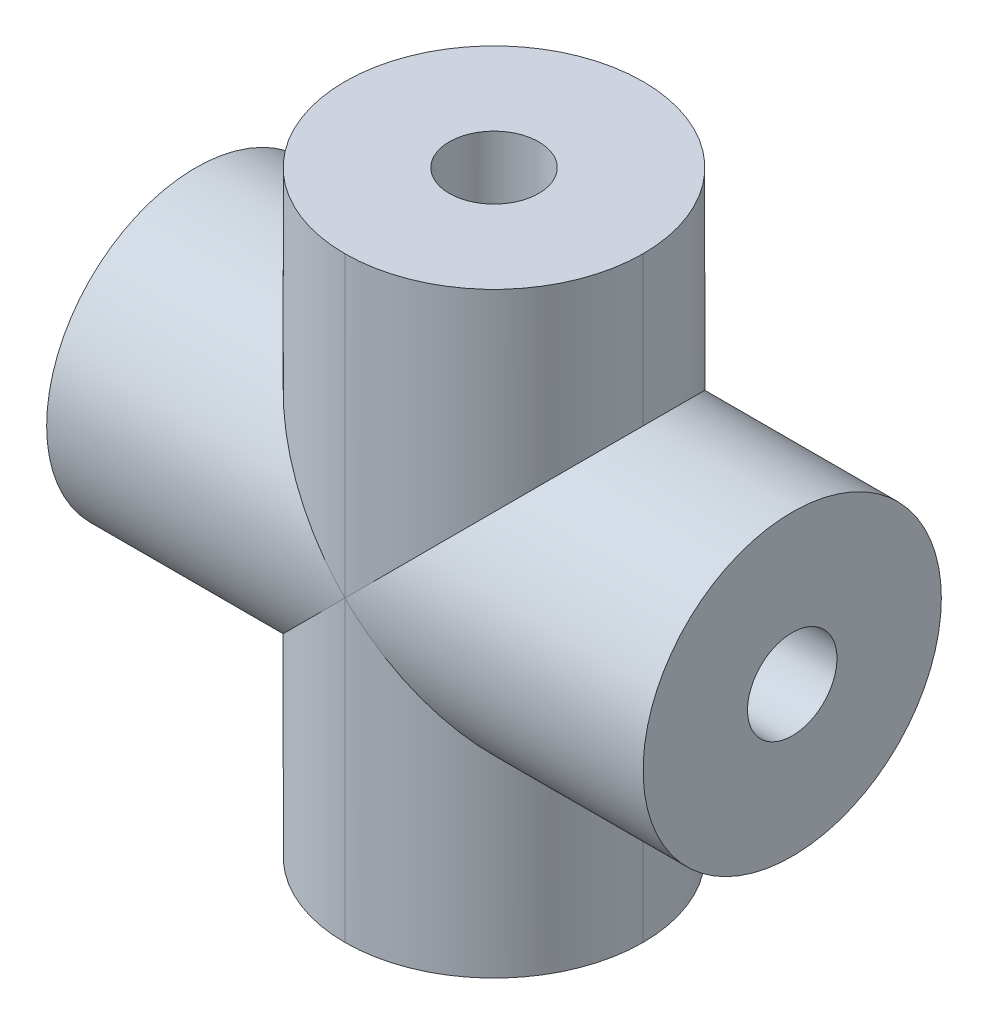
ISO-10303-21;
HEADER;
FILE_DESCRIPTION(('STEP AP214'),'2;1');
FILE_NAME('part.step','',(''),(''),'','','');
FILE_SCHEMA(('AUTOMOTIVE_DESIGN { 1 0 10303 214 1 1 1 1 }'));
ENDSEC;
DATA;
#1=APPLICATION_CONTEXT('core data for automotive mechanical design processes');
#2=APPLICATION_PROTOCOL_DEFINITION('international standard','automotive_design',2000,#1);
#3=PRODUCT_CONTEXT('',#1,'mechanical');
#4=PRODUCT('Part','Part','',(#3));
#5=PRODUCT_RELATED_PRODUCT_CATEGORY('part','',(#4));
#6=PRODUCT_DEFINITION_FORMATION('','',#4);
#7=PRODUCT_DEFINITION_CONTEXT('part definition',#1,'design');
#8=PRODUCT_DEFINITION('design','',#6,#7);
#9=PRODUCT_DEFINITION_SHAPE('','',#8);
#10=(LENGTH_UNIT() NAMED_UNIT(*) SI_UNIT(.MILLI.,.METRE.));
#11=(NAMED_UNIT(*) PLANE_ANGLE_UNIT() SI_UNIT($,.RADIAN.));
#12=(NAMED_UNIT(*) SI_UNIT($,.STERADIAN.) SOLID_ANGLE_UNIT());
#13=UNCERTAINTY_MEASURE_WITH_UNIT(LENGTH_MEASURE(1.E-05),#10,'distance_accuracy_value','');
#14=(GEOMETRIC_REPRESENTATION_CONTEXT(3) GLOBAL_UNCERTAINTY_ASSIGNED_CONTEXT((#13)) GLOBAL_UNIT_ASSIGNED_CONTEXT((#10,
#11,#12)) REPRESENTATION_CONTEXT('',''));
#15=CARTESIAN_POINT('',(0.,0.,0.));
#16=DIRECTION('',(0.,0.,1.));
#17=DIRECTION('',(1.,0.,0.));
#18=AXIS2_PLACEMENT_3D('',#15,#16,#17);
#19=CARTESIAN_POINT('',(-5.,20.,-4.99999999999999));
#20=DIRECTION('',(0.,1.,0.));
#21=DIRECTION('',(0.,0.,1.));
#22=AXIS2_PLACEMENT_3D('',#19,#20,#21);
#23=CYLINDRICAL_SURFACE('',#22,1.49999999999999);
#24=CARTESIAN_POINT('',(-5.,20.,-4.99999999999999));
#25=DIRECTION('',(0.,1.,0.));
#26=DIRECTION('',(0.,0.,1.));
#27=AXIS2_PLACEMENT_3D('',#24,#25,#26);
#28=CIRCLE('',#27,1.49999999999999);
#29=CARTESIAN_POINT('',(-5.,20.,-3.50000000000001));
#30=VERTEX_POINT('',#29);
#31=EDGE_CURVE('E175',#30,#30,#28,.T.);
#32=ORIENTED_EDGE('',*,*,#31,.T.);
#33=EDGE_LOOP('',(#32));
#34=FACE_BOUND('',#33,.T.);
#35=CARTESIAN_POINT('',(-5.,10.,-4.99999999999999));
#36=DIRECTION('',(0.707106781186547,0.707106781186547,0.));
#37=DIRECTION('',(-0.707106781186547,0.707106781186547,0.));
#38=AXIS2_PLACEMENT_3D('',#35,#36,#37);
#39=ELLIPSE('',#38,2.12132034355963,1.49999999999999);
#40=CARTESIAN_POINT('',(-5.,10.,-3.5));
#41=VERTEX_POINT('',#40);
#42=CARTESIAN_POINT('',(-5.,10.,-6.49999999999999));
#43=VERTEX_POINT('',#42);
#44=EDGE_CURVE('E46',#41,#43,#39,.F.);
#45=ORIENTED_EDGE('',*,*,#44,.T.);
#46=CARTESIAN_POINT('',(-5.,10.,-4.99999999999999));
#47=DIRECTION('',(-0.707106781186547,0.707106781186547,0.));
#48=DIRECTION('',(0.707106781186547,0.707106781186547,0.));
#49=AXIS2_PLACEMENT_3D('',#46,#47,#48);
#50=ELLIPSE('',#49,2.12132034355963,1.49999999999999);
#51=EDGE_CURVE('E11',#43,#41,#50,.F.);
#52=ORIENTED_EDGE('',*,*,#51,.T.);
#53=EDGE_LOOP('',(#45,#52));
#54=FACE_BOUND('',#53,.T.);
#55=ADVANCED_FACE('F33',(#34,#54),#23,.F.);
#56=CARTESIAN_POINT('',(0.,20.,0.));
#57=DIRECTION('',(0.,1.,0.));
#58=DIRECTION('',(0.,0.,1.));
#59=AXIS2_PLACEMENT_3D('',#56,#57,#58);
#60=PLANE('',#59);
#61=ORIENTED_EDGE('',*,*,#31,.F.);
#62=EDGE_LOOP('',(#61));
#63=FACE_BOUND('',#62,.T.);
#64=CARTESIAN_POINT('',(-5.,20.,-5.));
#65=DIRECTION('',(0.,1.,0.));
#66=DIRECTION('',(0.,0.,1.));
#67=AXIS2_PLACEMENT_3D('',#64,#65,#66);
#68=CIRCLE('',#67,5.);
#69=CARTESIAN_POINT('',(-5.,20.,0.));
#70=VERTEX_POINT('',#69);
#71=CARTESIAN_POINT('',(0.,20.,-5.));
#72=VERTEX_POINT('',#71);
#73=EDGE_CURVE('E155',#70,#72,#68,.T.);
#74=ORIENTED_EDGE('',*,*,#73,.T.);
#75=CARTESIAN_POINT('',(-5.,20.,-5.));
#76=DIRECTION('',(0.,1.,0.));
#77=DIRECTION('',(0.,0.,1.));
#78=AXIS2_PLACEMENT_3D('',#75,#76,#77);
#79=CIRCLE('',#78,5.);
#80=CARTESIAN_POINT('',(-5.00000000000001,20.,-9.99999999999999));
#81=VERTEX_POINT('',#80);
#82=EDGE_CURVE('E150',#72,#81,#79,.T.);
#83=ORIENTED_EDGE('',*,*,#82,.T.);
#84=CARTESIAN_POINT('',(-5.,20.,-5.));
#85=DIRECTION('',(0.,1.,0.));
#86=DIRECTION('',(0.,0.,1.));
#87=AXIS2_PLACEMENT_3D('',#84,#85,#86);
#88=CIRCLE('',#87,5.);
#89=CARTESIAN_POINT('',(-10.,20.,-5.));
#90=VERTEX_POINT('',#89);
#91=EDGE_CURVE('E153',#81,#90,#88,.T.);
#92=ORIENTED_EDGE('',*,*,#91,.T.);
#93=CARTESIAN_POINT('',(-5.,20.,-5.));
#94=DIRECTION('',(0.,1.,0.));
#95=DIRECTION('',(0.,0.,1.));
#96=AXIS2_PLACEMENT_3D('',#93,#94,#95);
#97=CIRCLE('',#96,5.);
#98=EDGE_CURVE('E157',#90,#70,#97,.T.);
#99=ORIENTED_EDGE('',*,*,#98,.T.);
#100=EDGE_LOOP('',(#74,#83,#92,#99));
#101=FACE_BOUND('',#100,.T.);
#102=ADVANCED_FACE('F200',(#63,#101),#60,.T.);
#103=CARTESIAN_POINT('',(0.,0.,0.));
#104=DIRECTION('',(0.,1.,0.));
#105=DIRECTION('',(0.,0.,1.));
#106=AXIS2_PLACEMENT_3D('',#103,#104,#105);
#107=PLANE('',#106);
#108=CARTESIAN_POINT('',(-5.,0.,-4.99999999999999));
#109=DIRECTION('',(0.,1.,0.));
#110=DIRECTION('',(0.,0.,1.));
#111=AXIS2_PLACEMENT_3D('',#108,#109,#110);
#112=CIRCLE('',#111,1.49999999999999);
#113=CARTESIAN_POINT('',(-5.,0.,-3.5));
#114=VERTEX_POINT('',#113);
#115=EDGE_CURVE('E131',#114,#114,#112,.T.);
#116=ORIENTED_EDGE('',*,*,#115,.T.);
#117=EDGE_LOOP('',(#116));
#118=FACE_BOUND('',#117,.T.);
#119=CARTESIAN_POINT('',(-5.,0.,-5.));
#120=DIRECTION('',(0.,1.,0.));
#121=DIRECTION('',(0.,0.,1.));
#122=AXIS2_PLACEMENT_3D('',#119,#120,#121);
#123=CIRCLE('',#122,5.);
#124=CARTESIAN_POINT('',(-10.,0.,-5.));
#125=VERTEX_POINT('',#124);
#126=CARTESIAN_POINT('',(-5.00000000000001,0.,-9.99999999999999));
#127=VERTEX_POINT('',#126);
#128=EDGE_CURVE('E162',#125,#127,#123,.F.);
#129=ORIENTED_EDGE('',*,*,#128,.T.);
#130=CARTESIAN_POINT('',(-5.,0.,-5.));
#131=DIRECTION('',(0.,1.,0.));
#132=DIRECTION('',(0.,0.,1.));
#133=AXIS2_PLACEMENT_3D('',#130,#131,#132);
#134=CIRCLE('',#133,5.);
#135=CARTESIAN_POINT('',(0.,0.,-5.));
#136=VERTEX_POINT('',#135);
#137=EDGE_CURVE('E159',#127,#136,#134,.F.);
#138=ORIENTED_EDGE('',*,*,#137,.T.);
#139=CARTESIAN_POINT('',(-5.,0.,-5.));
#140=DIRECTION('',(0.,1.,0.));
#141=DIRECTION('',(0.,0.,1.));
#142=AXIS2_PLACEMENT_3D('',#139,#140,#141);
#143=CIRCLE('',#142,5.);
#144=CARTESIAN_POINT('',(-5.,0.,0.));
#145=VERTEX_POINT('',#144);
#146=EDGE_CURVE('E164',#136,#145,#143,.F.);
#147=ORIENTED_EDGE('',*,*,#146,.T.);
#148=CARTESIAN_POINT('',(-5.,0.,-5.));
#149=DIRECTION('',(0.,1.,0.));
#150=DIRECTION('',(0.,0.,1.));
#151=AXIS2_PLACEMENT_3D('',#148,#149,#150);
#152=CIRCLE('',#151,5.);
#153=EDGE_CURVE('E166',#145,#125,#152,.F.);
#154=ORIENTED_EDGE('',*,*,#153,.T.);
#155=EDGE_LOOP('',(#129,#138,#147,#154));
#156=FACE_BOUND('',#155,.T.);
#157=ADVANCED_FACE('F195',(#118,#156),#107,.F.);
#158=CARTESIAN_POINT('',(-15.,10.,-4.99999999999999));
#159=DIRECTION('',(1.,0.,0.));
#160=DIRECTION('',(0.,0.,-1.));
#161=AXIS2_PLACEMENT_3D('',#158,#159,#160);
#162=CYLINDRICAL_SURFACE('',#161,5.);
#163=CARTESIAN_POINT('',(-5.,10.,-5.));
#164=DIRECTION('',(0.707106781186547,-0.707106781186547,0.));
#165=DIRECTION('',(0.707106781186547,0.707106781186547,0.));
#166=AXIS2_PLACEMENT_3D('',#163,#164,#165);
#167=ELLIPSE('',#166,7.07106781186548,5.);
#168=CARTESIAN_POINT('',(-10.,5.,-5.));
#169=VERTEX_POINT('',#168);
#170=CARTESIAN_POINT('',(-5.,10.,0.));
#171=VERTEX_POINT('',#170);
#172=EDGE_CURVE('E140',#169,#171,#167,.F.);
#173=ORIENTED_EDGE('',*,*,#172,.T.);
#174=CARTESIAN_POINT('',(-5.,10.,-5.));
#175=DIRECTION('',(0.707106781186547,0.707106781186547,0.));
#176=DIRECTION('',(0.707106781186547,-0.707106781186547,0.));
#177=AXIS2_PLACEMENT_3D('',#174,#175,#176);
#178=ELLIPSE('',#177,7.07106781186548,5.);
#179=CARTESIAN_POINT('',(-10.,15.,-5.));
#180=VERTEX_POINT('',#179);
#181=EDGE_CURVE('E54',#171,#180,#178,.F.);
#182=ORIENTED_EDGE('',*,*,#181,.T.);
#183=CARTESIAN_POINT('',(-5.,10.,-4.99999999999999));
#184=DIRECTION('',(0.707106781186547,0.707106781186547,0.));
#185=DIRECTION('',(0.707106781186547,-0.707106781186547,0.));
#186=AXIS2_PLACEMENT_3D('',#183,#184,#185);
#187=ELLIPSE('',#186,7.07106781186548,5.);
#188=CARTESIAN_POINT('',(-5.,10.,-9.99999999999999));
#189=VERTEX_POINT('',#188);
#190=EDGE_CURVE('E136',#180,#189,#187,.F.);
#191=ORIENTED_EDGE('',*,*,#190,.T.);
#192=CARTESIAN_POINT('',(-5.,10.,-4.99999999999999));
#193=DIRECTION('',(0.707106781186547,-0.707106781186547,0.));
#194=DIRECTION('',(0.707106781186547,0.707106781186547,0.));
#195=AXIS2_PLACEMENT_3D('',#192,#193,#194);
#196=ELLIPSE('',#195,7.07106781186548,5.);
#197=EDGE_CURVE('E144',#189,#169,#196,.F.);
#198=ORIENTED_EDGE('',*,*,#197,.T.);
#199=EDGE_LOOP('',(#173,#182,#191,#198));
#200=FACE_BOUND('',#199,.T.);
#201=CARTESIAN_POINT('',(-15.,10.,-4.99999999999999));
#202=DIRECTION('',(-1.,0.,0.));
#203=DIRECTION('',(0.,0.,1.));
#204=AXIS2_PLACEMENT_3D('',#201,#202,#203);
#205=CIRCLE('',#204,5.);
#206=CARTESIAN_POINT('',(-15.,10.,0.));
#207=VERTEX_POINT('',#206);
#208=EDGE_CURVE('E168',#207,#207,#205,.T.);
#209=ORIENTED_EDGE('',*,*,#208,.F.);
#210=EDGE_LOOP('',(#209));
#211=FACE_BOUND('',#210,.T.);
#212=ADVANCED_FACE('F190',(#200,#211),#162,.T.);
#213=CARTESIAN_POINT('',(-15.,10.,-4.99999999999999));
#214=DIRECTION('',(-1.,0.,0.));
#215=DIRECTION('',(0.,0.,1.));
#216=AXIS2_PLACEMENT_3D('',#213,#214,#215);
#217=PLANE('',#216);
#218=CARTESIAN_POINT('',(-15.,10.,-4.99999999999999));
#219=DIRECTION('',(-1.,0.,0.));
#220=DIRECTION('',(0.,0.,1.));
#221=AXIS2_PLACEMENT_3D('',#218,#219,#220);
#222=CIRCLE('',#221,1.49999999999999);
#223=CARTESIAN_POINT('',(-15.,10.,-3.50000000000001));
#224=VERTEX_POINT('',#223);
#225=EDGE_CURVE('E181',#224,#224,#222,.T.);
#226=ORIENTED_EDGE('',*,*,#225,.F.);
#227=EDGE_LOOP('',(#226));
#228=FACE_BOUND('',#227,.T.);
#229=ORIENTED_EDGE('',*,*,#208,.T.);
#230=EDGE_LOOP('',(#229));
#231=FACE_BOUND('',#230,.T.);
#232=ADVANCED_FACE('F186',(#228,#231),#217,.T.);
#233=CARTESIAN_POINT('',(5.,10.,-5.));
#234=DIRECTION('',(-1.,0.,0.));
#235=DIRECTION('',(0.,0.,1.));
#236=AXIS2_PLACEMENT_3D('',#233,#234,#235);
#237=CYLINDRICAL_SURFACE('',#236,5.);
#238=CARTESIAN_POINT('',(-5.,10.,-5.));
#239=DIRECTION('',(-0.707106781186547,0.707106781186547,0.));
#240=DIRECTION('',(-0.707106781186547,-0.707106781186547,0.));
#241=AXIS2_PLACEMENT_3D('',#238,#239,#240);
#242=ELLIPSE('',#241,7.07106781186547,5.);
#243=CARTESIAN_POINT('',(0.,15.,-5.));
#244=VERTEX_POINT('',#243);
#245=EDGE_CURVE('E138',#189,#244,#242,.F.);
#246=ORIENTED_EDGE('',*,*,#245,.T.);
#247=CARTESIAN_POINT('',(-5.,10.,-5.));
#248=DIRECTION('',(-0.707106781186547,0.707106781186547,0.));
#249=DIRECTION('',(-0.707106781186547,-0.707106781186547,0.));
#250=AXIS2_PLACEMENT_3D('',#247,#248,#249);
#251=ELLIPSE('',#250,7.07106781186547,5.);
#252=EDGE_CURVE('E133',#244,#171,#251,.F.);
#253=ORIENTED_EDGE('',*,*,#252,.T.);
#254=CARTESIAN_POINT('',(-5.,10.,-5.));
#255=DIRECTION('',(-0.707106781186547,-0.707106781186547,0.));
#256=DIRECTION('',(-0.707106781186547,0.707106781186547,0.));
#257=AXIS2_PLACEMENT_3D('',#254,#255,#256);
#258=ELLIPSE('',#257,7.07106781186547,5.);
#259=CARTESIAN_POINT('',(0.,5.,-5.));
#260=VERTEX_POINT('',#259);
#261=EDGE_CURVE('E142',#171,#260,#258,.F.);
#262=ORIENTED_EDGE('',*,*,#261,.T.);
#263=CARTESIAN_POINT('',(-5.,10.,-5.));
#264=DIRECTION('',(-0.707106781186547,-0.707106781186547,0.));
#265=DIRECTION('',(-0.707106781186547,0.707106781186547,0.));
#266=AXIS2_PLACEMENT_3D('',#263,#264,#265);
#267=ELLIPSE('',#266,7.07106781186547,5.);
#268=EDGE_CURVE('E147',#260,#189,#267,.F.);
#269=ORIENTED_EDGE('',*,*,#268,.T.);
#270=EDGE_LOOP('',(#246,#253,#262,#269));
#271=FACE_BOUND('',#270,.T.);
#272=CARTESIAN_POINT('',(5.,10.,-5.));
#273=DIRECTION('',(1.,0.,0.));
#274=DIRECTION('',(0.,0.,-1.));
#275=AXIS2_PLACEMENT_3D('',#272,#273,#274);
#276=CIRCLE('',#275,5.);
#277=CARTESIAN_POINT('',(5.,10.,-10.));
#278=VERTEX_POINT('',#277);
#279=EDGE_CURVE('E112',#278,#278,#276,.T.);
#280=ORIENTED_EDGE('',*,*,#279,.F.);
#281=EDGE_LOOP('',(#280));
#282=FACE_BOUND('',#281,.T.);
#283=ADVANCED_FACE('F189',(#271,#282),#237,.T.);
#284=CARTESIAN_POINT('',(5.,10.,-5.));
#285=DIRECTION('',(1.,0.,0.));
#286=DIRECTION('',(0.,0.,-1.));
#287=AXIS2_PLACEMENT_3D('',#284,#285,#286);
#288=PLANE('',#287);
#289=CARTESIAN_POINT('',(5.,10.,-5.));
#290=DIRECTION('',(-1.,0.,0.));
#291=DIRECTION('',(0.,0.,1.));
#292=AXIS2_PLACEMENT_3D('',#289,#290,#291);
#293=CIRCLE('',#292,1.49999999999999);
#294=CARTESIAN_POINT('',(5.,10.,-3.5));
#295=VERTEX_POINT('',#294);
#296=EDGE_CURVE('E178',#295,#295,#293,.T.);
#297=ORIENTED_EDGE('',*,*,#296,.T.);
#298=EDGE_LOOP('',(#297));
#299=FACE_BOUND('',#298,.T.);
#300=ORIENTED_EDGE('',*,*,#279,.T.);
#301=EDGE_LOOP('',(#300));
#302=FACE_BOUND('',#301,.T.);
#303=ADVANCED_FACE('F250',(#299,#302),#288,.T.);
#304=CARTESIAN_POINT('',(-5.,20.,-5.));
#305=DIRECTION('',(0.,-1.,0.));
#306=DIRECTION('',(0.,0.,-1.));
#307=AXIS2_PLACEMENT_3D('',#304,#305,#306);
#308=CYLINDRICAL_SURFACE('',#307,5.);
#309=DIRECTION('',(0.,-1.,0.));
#310=VECTOR('',#309,1.);
#311=CARTESIAN_POINT('',(-5.,20.,0.));
#312=LINE('',#311,#310);
#313=EDGE_CURVE('E109',#70,#171,#312,.T.);
#314=ORIENTED_EDGE('',*,*,#313,.F.);
#315=ORIENTED_EDGE('',*,*,#98,.F.);
#316=DIRECTION('',(0.,-1.,0.));
#317=VECTOR('',#316,1.);
#318=CARTESIAN_POINT('',(-10.,20.,-5.));
#319=LINE('',#318,#317);
#320=EDGE_CURVE('E113',#180,#90,#319,.F.);
#321=ORIENTED_EDGE('',*,*,#320,.F.);
#322=ORIENTED_EDGE('',*,*,#181,.F.);
#323=EDGE_LOOP('',(#314,#315,#321,#322));
#324=FACE_BOUND('',#323,.T.);
#325=ADVANCED_FACE('F35',(#324),#308,.T.);
#326=CARTESIAN_POINT('',(-5.,20.,-5.));
#327=DIRECTION('',(0.,-1.,0.));
#328=DIRECTION('',(0.,0.,-1.));
#329=AXIS2_PLACEMENT_3D('',#326,#327,#328);
#330=CYLINDRICAL_SURFACE('',#329,5.);
#331=ORIENTED_EDGE('',*,*,#73,.F.);
#332=ORIENTED_EDGE('',*,*,#313,.T.);
#333=ORIENTED_EDGE('',*,*,#252,.F.);
#334=DIRECTION('',(0.,-1.,0.));
#335=VECTOR('',#334,1.);
#336=CARTESIAN_POINT('',(0.,20.,-5.));
#337=LINE('',#336,#335);
#338=EDGE_CURVE('E119',#72,#244,#337,.T.);
#339=ORIENTED_EDGE('',*,*,#338,.F.);
#340=EDGE_LOOP('',(#331,#332,#333,#339));
#341=FACE_BOUND('',#340,.T.);
#342=ADVANCED_FACE('F243',(#341),#330,.T.);
#343=CARTESIAN_POINT('',(-5.,20.,-5.));
#344=DIRECTION('',(0.,-1.,0.));
#345=DIRECTION('',(0.,0.,-1.));
#346=AXIS2_PLACEMENT_3D('',#343,#344,#345);
#347=CYLINDRICAL_SURFACE('',#346,5.);
#348=ORIENTED_EDGE('',*,*,#320,.T.);
#349=ORIENTED_EDGE('',*,*,#91,.F.);
#350=DIRECTION('',(0.,-1.,0.));
#351=VECTOR('',#350,1.);
#352=CARTESIAN_POINT('',(-5.00000000000001,20.,-9.99999999999999));
#353=LINE('',#352,#351);
#354=EDGE_CURVE('E122',#189,#81,#353,.F.);
#355=ORIENTED_EDGE('',*,*,#354,.F.);
#356=ORIENTED_EDGE('',*,*,#190,.F.);
#357=EDGE_LOOP('',(#348,#349,#355,#356));
#358=FACE_BOUND('',#357,.T.);
#359=ADVANCED_FACE('F240',(#358),#347,.T.);
#360=CARTESIAN_POINT('',(-5.,20.,-5.));
#361=DIRECTION('',(0.,-1.,0.));
#362=DIRECTION('',(0.,0.,-1.));
#363=AXIS2_PLACEMENT_3D('',#360,#361,#362);
#364=CYLINDRICAL_SURFACE('',#363,5.);
#365=DIRECTION('',(0.,-1.,0.));
#366=VECTOR('',#365,1.);
#367=CARTESIAN_POINT('',(-10.,20.,-5.));
#368=LINE('',#367,#366);
#369=EDGE_CURVE('E124',#125,#169,#368,.F.);
#370=ORIENTED_EDGE('',*,*,#369,.F.);
#371=ORIENTED_EDGE('',*,*,#153,.F.);
#372=DIRECTION('',(0.,-1.,0.));
#373=VECTOR('',#372,1.);
#374=CARTESIAN_POINT('',(-5.,20.,0.));
#375=LINE('',#374,#373);
#376=EDGE_CURVE('E116',#171,#145,#375,.T.);
#377=ORIENTED_EDGE('',*,*,#376,.F.);
#378=ORIENTED_EDGE('',*,*,#172,.F.);
#379=EDGE_LOOP('',(#370,#371,#377,#378));
#380=FACE_BOUND('',#379,.T.);
#381=ADVANCED_FACE('F236',(#380),#364,.T.);
#382=CARTESIAN_POINT('',(-5.,20.,-5.));
#383=DIRECTION('',(0.,-1.,0.));
#384=DIRECTION('',(0.,0.,-1.));
#385=AXIS2_PLACEMENT_3D('',#382,#383,#384);
#386=CYLINDRICAL_SURFACE('',#385,5.);
#387=ORIENTED_EDGE('',*,*,#376,.T.);
#388=ORIENTED_EDGE('',*,*,#146,.F.);
#389=DIRECTION('',(0.,-1.,0.));
#390=VECTOR('',#389,1.);
#391=CARTESIAN_POINT('',(0.,20.,-5.));
#392=LINE('',#391,#390);
#393=EDGE_CURVE('E126',#260,#136,#392,.T.);
#394=ORIENTED_EDGE('',*,*,#393,.F.);
#395=ORIENTED_EDGE('',*,*,#261,.F.);
#396=EDGE_LOOP('',(#387,#388,#394,#395));
#397=FACE_BOUND('',#396,.T.);
#398=ADVANCED_FACE('F232',(#397),#386,.T.);
#399=CARTESIAN_POINT('',(-5.,20.,-5.));
#400=DIRECTION('',(0.,-1.,0.));
#401=DIRECTION('',(0.,0.,-1.));
#402=AXIS2_PLACEMENT_3D('',#399,#400,#401);
#403=CYLINDRICAL_SURFACE('',#402,5.);
#404=ORIENTED_EDGE('',*,*,#338,.T.);
#405=ORIENTED_EDGE('',*,*,#245,.F.);
#406=ORIENTED_EDGE('',*,*,#354,.T.);
#407=ORIENTED_EDGE('',*,*,#82,.F.);
#408=EDGE_LOOP('',(#404,#405,#406,#407));
#409=FACE_BOUND('',#408,.T.);
#410=ADVANCED_FACE('F225',(#409),#403,.T.);
#411=CARTESIAN_POINT('',(-5.,20.,-5.));
#412=DIRECTION('',(0.,-1.,0.));
#413=DIRECTION('',(0.,0.,-1.));
#414=AXIS2_PLACEMENT_3D('',#411,#412,#413);
#415=CYLINDRICAL_SURFACE('',#414,5.);
#416=ORIENTED_EDGE('',*,*,#197,.F.);
#417=DIRECTION('',(0.,-1.,0.));
#418=VECTOR('',#417,1.);
#419=CARTESIAN_POINT('',(-5.00000000000001,20.,-9.99999999999999));
#420=LINE('',#419,#418);
#421=EDGE_CURVE('E128',#127,#189,#420,.F.);
#422=ORIENTED_EDGE('',*,*,#421,.F.);
#423=ORIENTED_EDGE('',*,*,#128,.F.);
#424=ORIENTED_EDGE('',*,*,#369,.T.);
#425=EDGE_LOOP('',(#416,#422,#423,#424));
#426=FACE_BOUND('',#425,.T.);
#427=ADVANCED_FACE('F219',(#426),#415,.T.);
#428=CARTESIAN_POINT('',(-5.,20.,-5.));
#429=DIRECTION('',(0.,-1.,0.));
#430=DIRECTION('',(0.,0.,-1.));
#431=AXIS2_PLACEMENT_3D('',#428,#429,#430);
#432=CYLINDRICAL_SURFACE('',#431,5.);
#433=ORIENTED_EDGE('',*,*,#268,.F.);
#434=ORIENTED_EDGE('',*,*,#393,.T.);
#435=ORIENTED_EDGE('',*,*,#137,.F.);
#436=ORIENTED_EDGE('',*,*,#421,.T.);
#437=EDGE_LOOP('',(#433,#434,#435,#436));
#438=FACE_BOUND('',#437,.T.);
#439=ADVANCED_FACE('F214',(#438),#432,.T.);
#440=CARTESIAN_POINT('',(-5.,10.,-4.99999999999999));
#441=DIRECTION('',(0.707106781186547,0.707106781186547,0.));
#442=DIRECTION('',(-0.707106781186547,0.707106781186547,0.));
#443=AXIS2_PLACEMENT_3D('',#440,#441,#442);
#444=ELLIPSE('',#443,2.12132034355963,1.49999999999999);
#445=EDGE_CURVE('E98',#41,#43,#444,.T.);
#446=ORIENTED_EDGE('',*,*,#445,.T.);
#447=CARTESIAN_POINT('',(-5.,10.,-4.99999999999999));
#448=DIRECTION('',(-0.707106781186547,0.707106781186547,0.));
#449=DIRECTION('',(0.707106781186547,0.707106781186547,0.));
#450=AXIS2_PLACEMENT_3D('',#447,#448,#449);
#451=ELLIPSE('',#450,2.12132034355963,1.49999999999999);
#452=EDGE_CURVE('E41',#43,#41,#451,.T.);
#453=ORIENTED_EDGE('',*,*,#452,.T.);
#454=EDGE_LOOP('',(#446,#453));
#455=FACE_BOUND('',#454,.T.);
#456=ORIENTED_EDGE('',*,*,#115,.F.);
#457=EDGE_LOOP('',(#456));
#458=FACE_BOUND('',#457,.T.);
#459=ADVANCED_FACE('F106',(#455,#458),#23,.F.);
#460=CARTESIAN_POINT('',(-15.,10.,-4.99999999999999));
#461=DIRECTION('',(-1.,0.,0.));
#462=DIRECTION('',(0.,0.,1.));
#463=AXIS2_PLACEMENT_3D('',#460,#461,#462);
#464=CYLINDRICAL_SURFACE('',#463,1.49999999999999);
#465=ORIENTED_EDGE('',*,*,#225,.T.);
#466=EDGE_LOOP('',(#465));
#467=FACE_BOUND('',#466,.T.);
#468=ORIENTED_EDGE('',*,*,#44,.F.);
#469=ORIENTED_EDGE('',*,*,#452,.F.);
#470=EDGE_LOOP('',(#468,#469));
#471=FACE_BOUND('',#470,.T.);
#472=ADVANCED_FACE('F104',(#467,#471),#464,.F.);
#473=ORIENTED_EDGE('',*,*,#296,.F.);
#474=EDGE_LOOP('',(#473));
#475=FACE_BOUND('',#474,.T.);
#476=ORIENTED_EDGE('',*,*,#445,.F.);
#477=ORIENTED_EDGE('',*,*,#51,.F.);
#478=EDGE_LOOP('',(#476,#477));
#479=FACE_BOUND('',#478,.T.);
#480=ADVANCED_FACE('F99',(#475,#479),#464,.F.);
#481=CLOSED_SHELL('',(#55,#102,#157,#212,#232,#283,#303,#325,#342,#359,#381,#398,#410,#427,#439,
#459,#472,#480));
#482=MANIFOLD_SOLID_BREP('B2',#481);
#483=ADVANCED_BREP_SHAPE_REPRESENTATION('',(#18,#482),#14);
#484=SHAPE_DEFINITION_REPRESENTATION(#9,#483);
ENDSEC;
END-ISO-10303-21;
